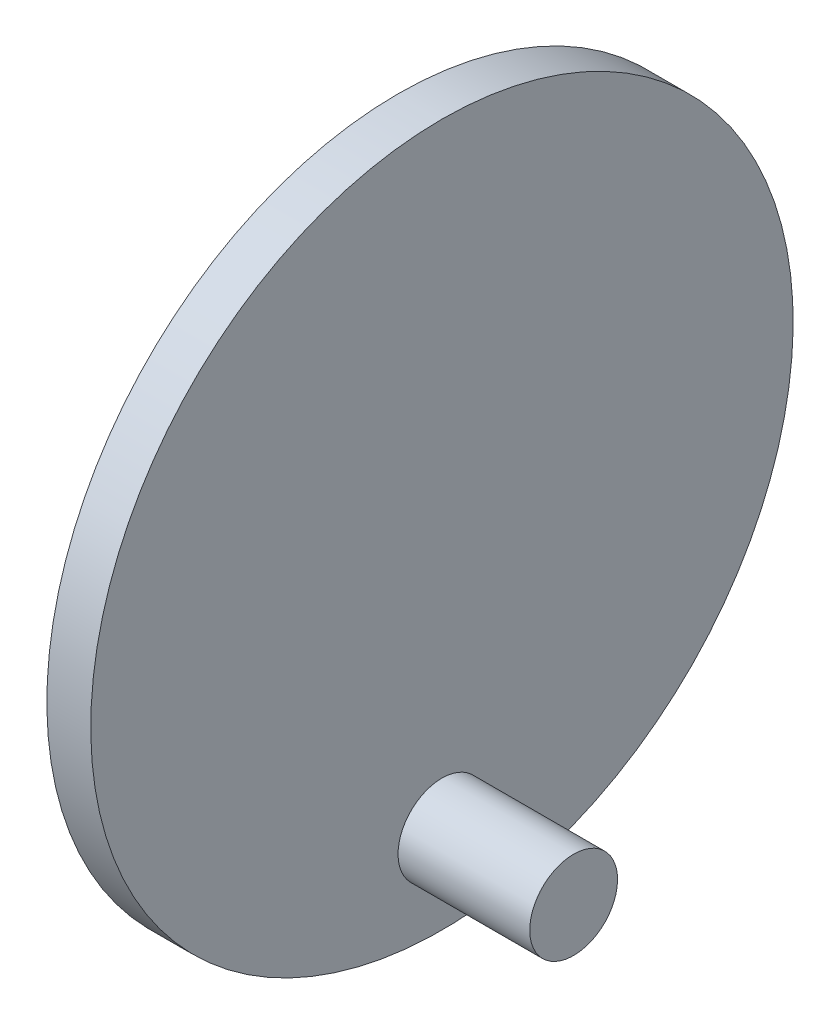
ISO-10303-21;
HEADER;
FILE_DESCRIPTION(('STEP AP214'),'2;1');
FILE_NAME('part.step','',(''),(''),'','','');
FILE_SCHEMA(('AUTOMOTIVE_DESIGN { 1 0 10303 214 1 1 1 1 }'));
ENDSEC;
DATA;
#1=APPLICATION_CONTEXT('core data for automotive mechanical design processes');
#2=APPLICATION_PROTOCOL_DEFINITION('international standard','automotive_design',2000,#1);
#3=PRODUCT_CONTEXT('',#1,'mechanical');
#4=PRODUCT('Part','Part','',(#3));
#5=PRODUCT_RELATED_PRODUCT_CATEGORY('part','',(#4));
#6=PRODUCT_DEFINITION_FORMATION('','',#4);
#7=PRODUCT_DEFINITION_CONTEXT('part definition',#1,'design');
#8=PRODUCT_DEFINITION('design','',#6,#7);
#9=PRODUCT_DEFINITION_SHAPE('','',#8);
#10=(LENGTH_UNIT() NAMED_UNIT(*) SI_UNIT(.MILLI.,.METRE.));
#11=(NAMED_UNIT(*) PLANE_ANGLE_UNIT() SI_UNIT($,.RADIAN.));
#12=(NAMED_UNIT(*) SI_UNIT($,.STERADIAN.) SOLID_ANGLE_UNIT());
#13=UNCERTAINTY_MEASURE_WITH_UNIT(LENGTH_MEASURE(1.E-05),#10,'distance_accuracy_value','');
#14=(GEOMETRIC_REPRESENTATION_CONTEXT(3) GLOBAL_UNCERTAINTY_ASSIGNED_CONTEXT((#13)) GLOBAL_UNIT_ASSIGNED_CONTEXT((#10,
#11,#12)) REPRESENTATION_CONTEXT('',''));
#15=CARTESIAN_POINT('',(0.,0.,0.));
#16=DIRECTION('',(0.,0.,1.));
#17=DIRECTION('',(1.,0.,0.));
#18=AXIS2_PLACEMENT_3D('',#15,#16,#17);
#19=CARTESIAN_POINT('',(-4.99999999999999,60.,0.));
#20=DIRECTION('',(1.,0.,0.));
#21=DIRECTION('',(0.,1.,0.));
#22=AXIS2_PLACEMENT_3D('',#19,#20,#21);
#23=CYLINDRICAL_SURFACE('',#22,7.5);
#24=CARTESIAN_POINT('',(-4.99999999999999,60.,0.));
#25=DIRECTION('',(1.,0.,0.));
#26=DIRECTION('',(0.,1.,0.));
#27=AXIS2_PLACEMENT_3D('',#24,#25,#26);
#28=CIRCLE('',#27,7.5);
#29=CARTESIAN_POINT('',(-4.99999999999999,67.5,0.));
#30=VERTEX_POINT('',#29);
#31=EDGE_CURVE('E10',#30,#30,#28,.T.);
#32=ORIENTED_EDGE('',*,*,#31,.T.);
#33=EDGE_LOOP('',(#32));
#34=FACE_BOUND('',#33,.T.);
#35=CARTESIAN_POINT('',(15.,60.,0.));
#36=DIRECTION('',(1.,0.,0.));
#37=DIRECTION('',(0.,1.,0.));
#38=AXIS2_PLACEMENT_3D('',#35,#36,#37);
#39=CIRCLE('',#38,7.5);
#40=CARTESIAN_POINT('',(15.,67.5,0.));
#41=VERTEX_POINT('',#40);
#42=EDGE_CURVE('E43',#41,#41,#39,.T.);
#43=ORIENTED_EDGE('',*,*,#42,.F.);
#44=EDGE_LOOP('',(#43));
#45=FACE_BOUND('',#44,.T.);
#46=ADVANCED_FACE('F37',(#34,#45),#23,.T.);
#47=CARTESIAN_POINT('',(-4.99999999999999,60.,0.));
#48=DIRECTION('',(1.,0.,0.));
#49=DIRECTION('',(0.,1.,0.));
#50=AXIS2_PLACEMENT_3D('',#47,#48,#49);
#51=PLANE('',#50);
#52=ORIENTED_EDGE('',*,*,#31,.F.);
#53=EDGE_LOOP('',(#52));
#54=FACE_BOUND('',#53,.T.);
#55=ADVANCED_FACE('F81',(#54),#51,.F.);
#56=CARTESIAN_POINT('',(20.,60.,0.));
#57=DIRECTION('',(-1.,0.,0.));
#58=DIRECTION('',(0.,-1.,0.));
#59=AXIS2_PLACEMENT_3D('',#56,#57,#58);
#60=CYLINDRICAL_SURFACE('',#59,40.);
#61=CARTESIAN_POINT('',(20.,60.,0.));
#62=DIRECTION('',(1.,0.,0.));
#63=DIRECTION('',(0.,1.,0.));
#64=AXIS2_PLACEMENT_3D('',#61,#62,#63);
#65=CIRCLE('',#64,40.);
#66=CARTESIAN_POINT('',(20.,100.,0.));
#67=VERTEX_POINT('',#66);
#68=EDGE_CURVE('E47',#67,#67,#65,.T.);
#69=ORIENTED_EDGE('',*,*,#68,.F.);
#70=EDGE_LOOP('',(#69));
#71=FACE_BOUND('',#70,.T.);
#72=CARTESIAN_POINT('',(15.,60.,0.));
#73=DIRECTION('',(1.,0.,0.));
#74=DIRECTION('',(0.,1.,0.));
#75=AXIS2_PLACEMENT_3D('',#72,#73,#74);
#76=CIRCLE('',#75,40.);
#77=CARTESIAN_POINT('',(15.,100.,0.));
#78=VERTEX_POINT('',#77);
#79=EDGE_CURVE('E51',#78,#78,#76,.T.);
#80=ORIENTED_EDGE('',*,*,#79,.T.);
#81=EDGE_LOOP('',(#80));
#82=FACE_BOUND('',#81,.T.);
#83=ADVANCED_FACE('F75',(#71,#82),#60,.T.);
#84=CARTESIAN_POINT('',(20.,60.,0.));
#85=DIRECTION('',(1.,0.,0.));
#86=DIRECTION('',(0.,1.,0.));
#87=AXIS2_PLACEMENT_3D('',#84,#85,#86);
#88=PLANE('',#87);
#89=CARTESIAN_POINT('',(20.,30.,0.));
#90=DIRECTION('',(1.,0.,0.));
#91=DIRECTION('',(0.,1.,0.));
#92=AXIS2_PLACEMENT_3D('',#89,#90,#91);
#93=CIRCLE('',#92,5.);
#94=CARTESIAN_POINT('',(20.,35.,0.));
#95=VERTEX_POINT('',#94);
#96=EDGE_CURVE('E57',#95,#95,#93,.T.);
#97=ORIENTED_EDGE('',*,*,#96,.F.);
#98=EDGE_LOOP('',(#97));
#99=FACE_BOUND('',#98,.T.);
#100=ORIENTED_EDGE('',*,*,#68,.T.);
#101=EDGE_LOOP('',(#100));
#102=FACE_BOUND('',#101,.T.);
#103=ADVANCED_FACE('F72',(#99,#102),#88,.T.);
#104=CARTESIAN_POINT('',(15.,60.,0.));
#105=DIRECTION('',(1.,0.,0.));
#106=DIRECTION('',(0.,1.,0.));
#107=AXIS2_PLACEMENT_3D('',#104,#105,#106);
#108=PLANE('',#107);
#109=ORIENTED_EDGE('',*,*,#42,.T.);
#110=EDGE_LOOP('',(#109));
#111=FACE_BOUND('',#110,.T.);
#112=ORIENTED_EDGE('',*,*,#79,.F.);
#113=EDGE_LOOP('',(#112));
#114=FACE_BOUND('',#113,.T.);
#115=ADVANCED_FACE('F68',(#111,#114),#108,.F.);
#116=CARTESIAN_POINT('',(35.,30.,0.));
#117=DIRECTION('',(-1.,0.,0.));
#118=DIRECTION('',(0.,-1.,0.));
#119=AXIS2_PLACEMENT_3D('',#116,#117,#118);
#120=CYLINDRICAL_SURFACE('',#119,5.);
#121=CARTESIAN_POINT('',(35.,30.,0.));
#122=DIRECTION('',(1.,0.,0.));
#123=DIRECTION('',(0.,1.,0.));
#124=AXIS2_PLACEMENT_3D('',#121,#122,#123);
#125=CIRCLE('',#124,5.);
#126=CARTESIAN_POINT('',(35.,35.,0.));
#127=VERTEX_POINT('',#126);
#128=EDGE_CURVE('E55',#127,#127,#125,.T.);
#129=ORIENTED_EDGE('',*,*,#128,.F.);
#130=EDGE_LOOP('',(#129));
#131=FACE_BOUND('',#130,.T.);
#132=ORIENTED_EDGE('',*,*,#96,.T.);
#133=EDGE_LOOP('',(#132));
#134=FACE_BOUND('',#133,.T.);
#135=ADVANCED_FACE('F65',(#131,#134),#120,.T.);
#136=CARTESIAN_POINT('',(35.,30.,0.));
#137=DIRECTION('',(1.,0.,0.));
#138=DIRECTION('',(0.,1.,0.));
#139=AXIS2_PLACEMENT_3D('',#136,#137,#138);
#140=PLANE('',#139);
#141=ORIENTED_EDGE('',*,*,#128,.T.);
#142=EDGE_LOOP('',(#141));
#143=FACE_BOUND('',#142,.T.);
#144=ADVANCED_FACE('F63',(#143),#140,.T.);
#145=CLOSED_SHELL('',(#46,#55,#83,#103,#115,#135,#144));
#146=MANIFOLD_SOLID_BREP('B2',#145);
#147=ADVANCED_BREP_SHAPE_REPRESENTATION('',(#18,#146),#14);
#148=SHAPE_DEFINITION_REPRESENTATION(#9,#147);
ENDSEC;
END-ISO-10303-21;
